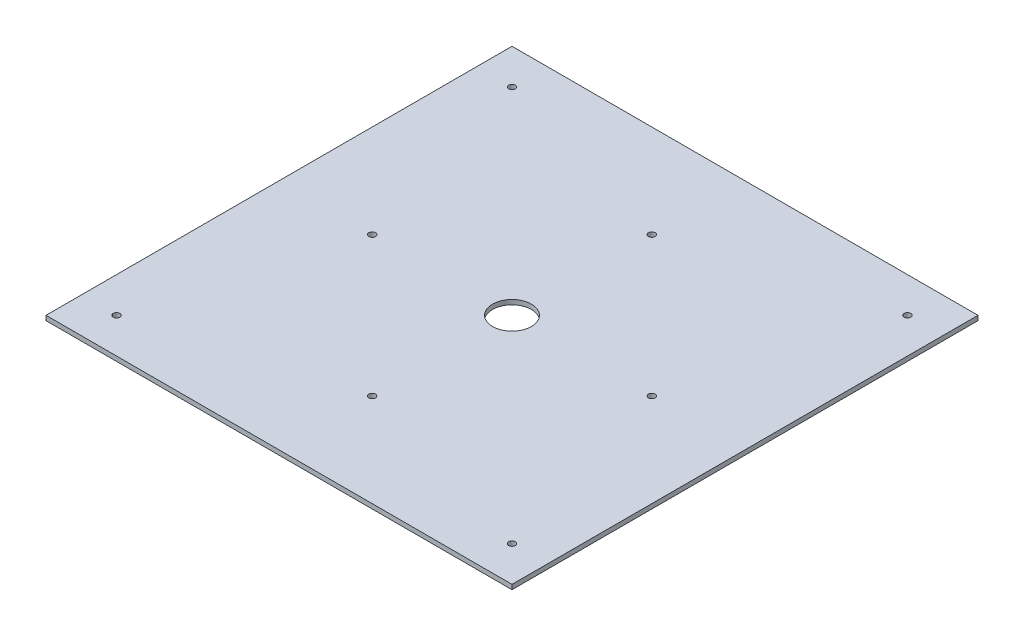
ISO-10303-21;
HEADER;
FILE_DESCRIPTION(('STEP AP214'),'2;1');
FILE_NAME('part.step','',(''),(''),'','','');
FILE_SCHEMA(('AUTOMOTIVE_DESIGN { 1 0 10303 214 1 1 1 1 }'));
ENDSEC;
DATA;
#1=APPLICATION_CONTEXT('core data for automotive mechanical design processes');
#2=APPLICATION_PROTOCOL_DEFINITION('international standard','automotive_design',2000,#1);
#3=PRODUCT_CONTEXT('',#1,'mechanical');
#4=PRODUCT('Part','Part','',(#3));
#5=PRODUCT_RELATED_PRODUCT_CATEGORY('part','',(#4));
#6=PRODUCT_DEFINITION_FORMATION('','',#4);
#7=PRODUCT_DEFINITION_CONTEXT('part definition',#1,'design');
#8=PRODUCT_DEFINITION('design','',#6,#7);
#9=PRODUCT_DEFINITION_SHAPE('','',#8);
#10=(LENGTH_UNIT() NAMED_UNIT(*) SI_UNIT(.MILLI.,.METRE.));
#11=(NAMED_UNIT(*) PLANE_ANGLE_UNIT() SI_UNIT($,.RADIAN.));
#12=(NAMED_UNIT(*) SI_UNIT($,.STERADIAN.) SOLID_ANGLE_UNIT());
#13=UNCERTAINTY_MEASURE_WITH_UNIT(LENGTH_MEASURE(1.E-05),#10,'distance_accuracy_value','');
#14=(GEOMETRIC_REPRESENTATION_CONTEXT(3) GLOBAL_UNCERTAINTY_ASSIGNED_CONTEXT((#13)) GLOBAL_UNIT_ASSIGNED_CONTEXT((#10,
#11,#12)) REPRESENTATION_CONTEXT('',''));
#15=CARTESIAN_POINT('',(0.,0.,0.));
#16=DIRECTION('',(0.,0.,1.));
#17=DIRECTION('',(1.,0.,0.));
#18=AXIS2_PLACEMENT_3D('',#15,#16,#17);
#19=CARTESIAN_POINT('',(0.,3.,0.));
#20=DIRECTION('',(0.,-1.,0.));
#21=DIRECTION('',(0.,0.,-1.));
#22=AXIS2_PLACEMENT_3D('',#19,#20,#21);
#23=PLANE('',#22);
#24=DIRECTION('',(0.,0.,1.));
#25=VECTOR('',#24,1.);
#26=CARTESIAN_POINT('',(0.,3.,0.));
#27=LINE('',#26,#25);
#28=CARTESIAN_POINT('',(0.,3.,-300.));
#29=VERTEX_POINT('',#28);
#30=CARTESIAN_POINT('',(0.,3.,0.));
#31=VERTEX_POINT('',#30);
#32=EDGE_CURVE('E92',#29,#31,#27,.T.);
#33=ORIENTED_EDGE('',*,*,#32,.T.);
#34=DIRECTION('',(1.,0.,0.));
#35=VECTOR('',#34,1.);
#36=CARTESIAN_POINT('',(0.,3.,0.));
#37=LINE('',#36,#35);
#38=CARTESIAN_POINT('',(300.,3.,0.));
#39=VERTEX_POINT('',#38);
#40=EDGE_CURVE('E87',#31,#39,#37,.T.);
#41=ORIENTED_EDGE('',*,*,#40,.T.);
#42=DIRECTION('',(0.,0.,-1.));
#43=VECTOR('',#42,1.);
#44=CARTESIAN_POINT('',(300.,3.,0.));
#45=LINE('',#44,#43);
#46=CARTESIAN_POINT('',(300.,3.,-300.));
#47=VERTEX_POINT('',#46);
#48=EDGE_CURVE('E90',#39,#47,#45,.T.);
#49=ORIENTED_EDGE('',*,*,#48,.T.);
#50=DIRECTION('',(-1.,0.,0.));
#51=VECTOR('',#50,1.);
#52=CARTESIAN_POINT('',(0.,3.,-300.));
#53=LINE('',#52,#51);
#54=EDGE_CURVE('E57',#47,#29,#53,.T.);
#55=ORIENTED_EDGE('',*,*,#54,.T.);
#56=EDGE_LOOP('',(#33,#41,#49,#55));
#57=FACE_BOUND('',#56,.T.);
#58=CARTESIAN_POINT('',(150.,3.,-150.));
#59=DIRECTION('',(0.,1.,0.));
#60=DIRECTION('',(0.,0.,1.));
#61=AXIS2_PLACEMENT_3D('',#58,#59,#60);
#62=CIRCLE('',#61,12.5);
#63=CARTESIAN_POINT('',(150.,3.,-137.5));
#64=VERTEX_POINT('',#63);
#65=EDGE_CURVE('E112',#64,#64,#62,.T.);
#66=ORIENTED_EDGE('',*,*,#65,.F.);
#67=EDGE_LOOP('',(#66));
#68=FACE_BOUND('',#67,.T.);
#69=CARTESIAN_POINT('',(22.7207793864215,3.,-277.279220613579));
#70=DIRECTION('',(0.,1.,0.));
#71=DIRECTION('',(0.,0.,1.));
#72=AXIS2_PLACEMENT_3D('',#69,#70,#71);
#73=CIRCLE('',#72,2.15);
#74=CARTESIAN_POINT('',(22.7207793864215,3.,-275.129220613579));
#75=VERTEX_POINT('',#74);
#76=EDGE_CURVE('E134',#75,#75,#73,.T.);
#77=ORIENTED_EDGE('',*,*,#76,.F.);
#78=EDGE_LOOP('',(#77));
#79=FACE_BOUND('',#78,.T.);
#80=CARTESIAN_POINT('',(150.,3.,-240.));
#81=DIRECTION('',(0.,1.,0.));
#82=DIRECTION('',(0.,0.,1.));
#83=AXIS2_PLACEMENT_3D('',#80,#81,#82);
#84=CIRCLE('',#83,2.15000000000002);
#85=CARTESIAN_POINT('',(150.,3.,-237.85));
#86=VERTEX_POINT('',#85);
#87=EDGE_CURVE('E142',#86,#86,#84,.T.);
#88=ORIENTED_EDGE('',*,*,#87,.F.);
#89=EDGE_LOOP('',(#88));
#90=FACE_BOUND('',#89,.T.);
#91=CARTESIAN_POINT('',(277.279220613579,3.,-277.279220613579));
#92=DIRECTION('',(0.,1.,0.));
#93=DIRECTION('',(0.,0.,1.));
#94=AXIS2_PLACEMENT_3D('',#91,#92,#93);
#95=CIRCLE('',#94,2.14999999999997);
#96=CARTESIAN_POINT('',(277.279220613579,3.,-275.129220613579));
#97=VERTEX_POINT('',#96);
#98=EDGE_CURVE('E150',#97,#97,#95,.T.);
#99=ORIENTED_EDGE('',*,*,#98,.F.);
#100=EDGE_LOOP('',(#99));
#101=FACE_BOUND('',#100,.T.);
#102=CARTESIAN_POINT('',(277.279220613579,3.,-22.7207793864214));
#103=DIRECTION('',(0.,1.,0.));
#104=DIRECTION('',(0.,0.,1.));
#105=AXIS2_PLACEMENT_3D('',#102,#103,#104);
#106=CIRCLE('',#105,2.14999999999996);
#107=CARTESIAN_POINT('',(277.279220613579,3.,-20.5707793864215));
#108=VERTEX_POINT('',#107);
#109=EDGE_CURVE('E158',#108,#108,#106,.T.);
#110=ORIENTED_EDGE('',*,*,#109,.F.);
#111=EDGE_LOOP('',(#110));
#112=FACE_BOUND('',#111,.T.);
#113=CARTESIAN_POINT('',(22.7207793864215,3.,-22.7207793864214));
#114=DIRECTION('',(0.,1.,0.));
#115=DIRECTION('',(0.,0.,1.));
#116=AXIS2_PLACEMENT_3D('',#113,#114,#115);
#117=CIRCLE('',#116,2.15);
#118=CARTESIAN_POINT('',(22.7207793864215,3.,-20.5707793864214));
#119=VERTEX_POINT('',#118);
#120=EDGE_CURVE('E166',#119,#119,#117,.T.);
#121=ORIENTED_EDGE('',*,*,#120,.F.);
#122=EDGE_LOOP('',(#121));
#123=FACE_BOUND('',#122,.T.);
#124=CARTESIAN_POINT('',(240.000000000001,3.,-150.000000000001));
#125=DIRECTION('',(0.,1.,0.));
#126=DIRECTION('',(0.,0.,1.));
#127=AXIS2_PLACEMENT_3D('',#124,#125,#126);
#128=CIRCLE('',#127,2.15000000000002);
#129=CARTESIAN_POINT('',(240.000000000001,3.,-147.850000000001));
#130=VERTEX_POINT('',#129);
#131=EDGE_CURVE('E174',#130,#130,#128,.T.);
#132=ORIENTED_EDGE('',*,*,#131,.F.);
#133=EDGE_LOOP('',(#132));
#134=FACE_BOUND('',#133,.T.);
#135=CARTESIAN_POINT('',(150.000000000002,3.,-60.));
#136=DIRECTION('',(0.,1.,0.));
#137=DIRECTION('',(0.,0.,1.));
#138=AXIS2_PLACEMENT_3D('',#135,#136,#137);
#139=CIRCLE('',#138,2.15000000000004);
#140=CARTESIAN_POINT('',(150.000000000002,3.,-57.85));
#141=VERTEX_POINT('',#140);
#142=EDGE_CURVE('E182',#141,#141,#139,.T.);
#143=ORIENTED_EDGE('',*,*,#142,.F.);
#144=EDGE_LOOP('',(#143));
#145=FACE_BOUND('',#144,.T.);
#146=CARTESIAN_POINT('',(60.0000000000012,3.,-150.));
#147=DIRECTION('',(0.,1.,0.));
#148=DIRECTION('',(0.,0.,1.));
#149=AXIS2_PLACEMENT_3D('',#146,#147,#148);
#150=CIRCLE('',#149,2.15000000000002);
#151=CARTESIAN_POINT('',(60.0000000000012,3.,-147.85));
#152=VERTEX_POINT('',#151);
#153=EDGE_CURVE('E190',#152,#152,#150,.T.);
#154=ORIENTED_EDGE('',*,*,#153,.F.);
#155=EDGE_LOOP('',(#154));
#156=FACE_BOUND('',#155,.T.);
#157=ADVANCED_FACE('F39',(#57,#68,#79,#90,#101,#112,#123,#134,#145,#156),#23,.F.);
#158=CARTESIAN_POINT('',(0.,0.,0.));
#159=DIRECTION('',(0.,-1.,0.));
#160=DIRECTION('',(0.,0.,-1.));
#161=AXIS2_PLACEMENT_3D('',#158,#159,#160);
#162=PLANE('',#161);
#163=CARTESIAN_POINT('',(150.000000000002,0.,-60.));
#164=DIRECTION('',(0.,1.,0.));
#165=DIRECTION('',(0.,0.,1.));
#166=AXIS2_PLACEMENT_3D('',#163,#164,#165);
#167=CIRCLE('',#166,2.15000000000004);
#168=CARTESIAN_POINT('',(150.000000000002,0.,-57.85));
#169=VERTEX_POINT('',#168);
#170=EDGE_CURVE('E186',#169,#169,#167,.T.);
#171=ORIENTED_EDGE('',*,*,#170,.T.);
#172=EDGE_LOOP('',(#171));
#173=FACE_BOUND('',#172,.T.);
#174=CARTESIAN_POINT('',(22.7207793864215,0.,-22.7207793864214));
#175=DIRECTION('',(0.,1.,0.));
#176=DIRECTION('',(0.,0.,1.));
#177=AXIS2_PLACEMENT_3D('',#174,#175,#176);
#178=CIRCLE('',#177,2.15);
#179=CARTESIAN_POINT('',(22.7207793864215,0.,-20.5707793864214));
#180=VERTEX_POINT('',#179);
#181=EDGE_CURVE('E170',#180,#180,#178,.T.);
#182=ORIENTED_EDGE('',*,*,#181,.T.);
#183=EDGE_LOOP('',(#182));
#184=FACE_BOUND('',#183,.T.);
#185=CARTESIAN_POINT('',(277.279220613579,0.,-277.279220613579));
#186=DIRECTION('',(0.,1.,0.));
#187=DIRECTION('',(0.,0.,1.));
#188=AXIS2_PLACEMENT_3D('',#185,#186,#187);
#189=CIRCLE('',#188,2.14999999999997);
#190=CARTESIAN_POINT('',(277.279220613579,0.,-275.129220613579));
#191=VERTEX_POINT('',#190);
#192=EDGE_CURVE('E154',#191,#191,#189,.T.);
#193=ORIENTED_EDGE('',*,*,#192,.T.);
#194=EDGE_LOOP('',(#193));
#195=FACE_BOUND('',#194,.T.);
#196=CARTESIAN_POINT('',(22.7207793864215,0.,-277.279220613579));
#197=DIRECTION('',(0.,1.,0.));
#198=DIRECTION('',(0.,0.,1.));
#199=AXIS2_PLACEMENT_3D('',#196,#197,#198);
#200=CIRCLE('',#199,2.15);
#201=CARTESIAN_POINT('',(22.7207793864215,0.,-275.129220613579));
#202=VERTEX_POINT('',#201);
#203=EDGE_CURVE('E138',#202,#202,#200,.T.);
#204=ORIENTED_EDGE('',*,*,#203,.T.);
#205=EDGE_LOOP('',(#204));
#206=FACE_BOUND('',#205,.T.);
#207=DIRECTION('',(0.,0.,1.));
#208=VECTOR('',#207,1.);
#209=CARTESIAN_POINT('',(0.,0.,0.));
#210=LINE('',#209,#208);
#211=CARTESIAN_POINT('',(0.,0.,-300.));
#212=VERTEX_POINT('',#211);
#213=CARTESIAN_POINT('',(0.,0.,0.));
#214=VERTEX_POINT('',#213);
#215=EDGE_CURVE('E108',#212,#214,#210,.T.);
#216=ORIENTED_EDGE('',*,*,#215,.F.);
#217=DIRECTION('',(-1.,0.,0.));
#218=VECTOR('',#217,1.);
#219=CARTESIAN_POINT('',(0.,0.,-300.));
#220=LINE('',#219,#218);
#221=CARTESIAN_POINT('',(300.,0.,-300.));
#222=VERTEX_POINT('',#221);
#223=EDGE_CURVE('E80',#222,#212,#220,.T.);
#224=ORIENTED_EDGE('',*,*,#223,.F.);
#225=DIRECTION('',(0.,0.,-1.));
#226=VECTOR('',#225,1.);
#227=CARTESIAN_POINT('',(300.,0.,0.));
#228=LINE('',#227,#226);
#229=CARTESIAN_POINT('',(300.,0.,0.));
#230=VERTEX_POINT('',#229);
#231=EDGE_CURVE('E74',#230,#222,#228,.T.);
#232=ORIENTED_EDGE('',*,*,#231,.F.);
#233=DIRECTION('',(1.,0.,0.));
#234=VECTOR('',#233,1.);
#235=CARTESIAN_POINT('',(0.,0.,0.));
#236=LINE('',#235,#234);
#237=EDGE_CURVE('E97',#214,#230,#236,.T.);
#238=ORIENTED_EDGE('',*,*,#237,.F.);
#239=EDGE_LOOP('',(#216,#224,#232,#238));
#240=FACE_BOUND('',#239,.T.);
#241=CARTESIAN_POINT('',(150.,0.,-150.));
#242=DIRECTION('',(0.,1.,0.));
#243=DIRECTION('',(0.,0.,1.));
#244=AXIS2_PLACEMENT_3D('',#241,#242,#243);
#245=CIRCLE('',#244,12.5);
#246=CARTESIAN_POINT('',(150.,0.,-137.5));
#247=VERTEX_POINT('',#246);
#248=EDGE_CURVE('E130',#247,#247,#245,.T.);
#249=ORIENTED_EDGE('',*,*,#248,.T.);
#250=EDGE_LOOP('',(#249));
#251=FACE_BOUND('',#250,.T.);
#252=CARTESIAN_POINT('',(150.,0.,-240.));
#253=DIRECTION('',(0.,1.,0.));
#254=DIRECTION('',(0.,0.,1.));
#255=AXIS2_PLACEMENT_3D('',#252,#253,#254);
#256=CIRCLE('',#255,2.15000000000002);
#257=CARTESIAN_POINT('',(150.,0.,-237.85));
#258=VERTEX_POINT('',#257);
#259=EDGE_CURVE('E146',#258,#258,#256,.T.);
#260=ORIENTED_EDGE('',*,*,#259,.T.);
#261=EDGE_LOOP('',(#260));
#262=FACE_BOUND('',#261,.T.);
#263=CARTESIAN_POINT('',(277.279220613579,0.,-22.7207793864214));
#264=DIRECTION('',(0.,1.,0.));
#265=DIRECTION('',(0.,0.,1.));
#266=AXIS2_PLACEMENT_3D('',#263,#264,#265);
#267=CIRCLE('',#266,2.14999999999996);
#268=CARTESIAN_POINT('',(277.279220613579,0.,-20.5707793864215));
#269=VERTEX_POINT('',#268);
#270=EDGE_CURVE('E162',#269,#269,#267,.T.);
#271=ORIENTED_EDGE('',*,*,#270,.T.);
#272=EDGE_LOOP('',(#271));
#273=FACE_BOUND('',#272,.T.);
#274=CARTESIAN_POINT('',(240.000000000001,0.,-150.000000000001));
#275=DIRECTION('',(0.,1.,0.));
#276=DIRECTION('',(0.,0.,1.));
#277=AXIS2_PLACEMENT_3D('',#274,#275,#276);
#278=CIRCLE('',#277,2.15000000000002);
#279=CARTESIAN_POINT('',(240.000000000001,0.,-147.850000000001));
#280=VERTEX_POINT('',#279);
#281=EDGE_CURVE('E178',#280,#280,#278,.T.);
#282=ORIENTED_EDGE('',*,*,#281,.T.);
#283=EDGE_LOOP('',(#282));
#284=FACE_BOUND('',#283,.T.);
#285=CARTESIAN_POINT('',(60.0000000000012,0.,-150.));
#286=DIRECTION('',(0.,1.,0.));
#287=DIRECTION('',(0.,0.,1.));
#288=AXIS2_PLACEMENT_3D('',#285,#286,#287);
#289=CIRCLE('',#288,2.15000000000002);
#290=CARTESIAN_POINT('',(60.0000000000012,0.,-147.85));
#291=VERTEX_POINT('',#290);
#292=EDGE_CURVE('E194',#291,#291,#289,.T.);
#293=ORIENTED_EDGE('',*,*,#292,.T.);
#294=EDGE_LOOP('',(#293));
#295=FACE_BOUND('',#294,.T.);
#296=ADVANCED_FACE('F125',(#173,#184,#195,#206,#240,#251,#262,#273,#284,#295),#162,.T.);
#297=CARTESIAN_POINT('',(0.,3.,0.));
#298=DIRECTION('',(1.,0.,0.));
#299=DIRECTION('',(0.,0.,-1.));
#300=AXIS2_PLACEMENT_3D('',#297,#298,#299);
#301=PLANE('',#300);
#302=ORIENTED_EDGE('',*,*,#215,.T.);
#303=DIRECTION('',(0.,-1.,0.));
#304=VECTOR('',#303,1.);
#305=CARTESIAN_POINT('',(0.,3.,0.));
#306=LINE('',#305,#304);
#307=EDGE_CURVE('E11',#31,#214,#306,.T.);
#308=ORIENTED_EDGE('',*,*,#307,.F.);
#309=ORIENTED_EDGE('',*,*,#32,.F.);
#310=DIRECTION('',(0.,-1.,0.));
#311=VECTOR('',#310,1.);
#312=CARTESIAN_POINT('',(0.,3.,-300.));
#313=LINE('',#312,#311);
#314=EDGE_CURVE('E104',#29,#212,#313,.T.);
#315=ORIENTED_EDGE('',*,*,#314,.T.);
#316=EDGE_LOOP('',(#302,#308,#309,#315));
#317=FACE_BOUND('',#316,.T.);
#318=ADVANCED_FACE('F41',(#317),#301,.F.);
#319=CARTESIAN_POINT('',(0.,3.,0.));
#320=DIRECTION('',(0.,0.,-1.));
#321=DIRECTION('',(-1.,0.,0.));
#322=AXIS2_PLACEMENT_3D('',#319,#320,#321);
#323=PLANE('',#322);
#324=ORIENTED_EDGE('',*,*,#237,.T.);
#325=DIRECTION('',(0.,-1.,0.));
#326=VECTOR('',#325,1.);
#327=CARTESIAN_POINT('',(300.,3.,0.));
#328=LINE('',#327,#326);
#329=EDGE_CURVE('E49',#39,#230,#328,.T.);
#330=ORIENTED_EDGE('',*,*,#329,.F.);
#331=ORIENTED_EDGE('',*,*,#40,.F.);
#332=ORIENTED_EDGE('',*,*,#307,.T.);
#333=EDGE_LOOP('',(#324,#330,#331,#332));
#334=FACE_BOUND('',#333,.T.);
#335=ADVANCED_FACE('F96',(#334),#323,.F.);
#336=CARTESIAN_POINT('',(300.,3.,0.));
#337=DIRECTION('',(-1.,0.,0.));
#338=DIRECTION('',(0.,0.,1.));
#339=AXIS2_PLACEMENT_3D('',#336,#337,#338);
#340=PLANE('',#339);
#341=ORIENTED_EDGE('',*,*,#231,.T.);
#342=DIRECTION('',(0.,-1.,0.));
#343=VECTOR('',#342,1.);
#344=CARTESIAN_POINT('',(300.,3.,-300.));
#345=LINE('',#344,#343);
#346=EDGE_CURVE('E99',#47,#222,#345,.T.);
#347=ORIENTED_EDGE('',*,*,#346,.F.);
#348=ORIENTED_EDGE('',*,*,#48,.F.);
#349=ORIENTED_EDGE('',*,*,#329,.T.);
#350=EDGE_LOOP('',(#341,#347,#348,#349));
#351=FACE_BOUND('',#350,.T.);
#352=ADVANCED_FACE('F100',(#351),#340,.F.);
#353=CARTESIAN_POINT('',(0.,3.,-300.));
#354=DIRECTION('',(0.,0.,1.));
#355=DIRECTION('',(1.,0.,0.));
#356=AXIS2_PLACEMENT_3D('',#353,#354,#355);
#357=PLANE('',#356);
#358=ORIENTED_EDGE('',*,*,#223,.T.);
#359=ORIENTED_EDGE('',*,*,#314,.F.);
#360=ORIENTED_EDGE('',*,*,#54,.F.);
#361=ORIENTED_EDGE('',*,*,#346,.T.);
#362=EDGE_LOOP('',(#358,#359,#360,#361));
#363=FACE_BOUND('',#362,.T.);
#364=ADVANCED_FACE('F122',(#363),#357,.F.);
#365=CARTESIAN_POINT('',(150.,3.,-150.));
#366=DIRECTION('',(0.,-1.,0.));
#367=DIRECTION('',(0.,0.,-1.));
#368=AXIS2_PLACEMENT_3D('',#365,#366,#367);
#369=CYLINDRICAL_SURFACE('',#368,12.5);
#370=ORIENTED_EDGE('',*,*,#65,.T.);
#371=EDGE_LOOP('',(#370));
#372=FACE_BOUND('',#371,.T.);
#373=ORIENTED_EDGE('',*,*,#248,.F.);
#374=EDGE_LOOP('',(#373));
#375=FACE_BOUND('',#374,.T.);
#376=ADVANCED_FACE('F213',(#372,#375),#369,.F.);
#377=CARTESIAN_POINT('',(22.7207793864215,3.,-277.279220613579));
#378=DIRECTION('',(0.,-1.,0.));
#379=DIRECTION('',(0.,0.,-1.));
#380=AXIS2_PLACEMENT_3D('',#377,#378,#379);
#381=CYLINDRICAL_SURFACE('',#380,2.15);
#382=ORIENTED_EDGE('',*,*,#76,.T.);
#383=EDGE_LOOP('',(#382));
#384=FACE_BOUND('',#383,.T.);
#385=ORIENTED_EDGE('',*,*,#203,.F.);
#386=EDGE_LOOP('',(#385));
#387=FACE_BOUND('',#386,.T.);
#388=ADVANCED_FACE('F259',(#384,#387),#381,.F.);
#389=CARTESIAN_POINT('',(150.,3.,-240.));
#390=DIRECTION('',(0.,-1.,0.));
#391=DIRECTION('',(0.,0.,-1.));
#392=AXIS2_PLACEMENT_3D('',#389,#390,#391);
#393=CYLINDRICAL_SURFACE('',#392,2.15000000000002);
#394=ORIENTED_EDGE('',*,*,#87,.T.);
#395=EDGE_LOOP('',(#394));
#396=FACE_BOUND('',#395,.T.);
#397=ORIENTED_EDGE('',*,*,#259,.F.);
#398=EDGE_LOOP('',(#397));
#399=FACE_BOUND('',#398,.T.);
#400=ADVANCED_FACE('F267',(#396,#399),#393,.F.);
#401=CARTESIAN_POINT('',(277.279220613579,3.,-277.279220613579));
#402=DIRECTION('',(0.,-1.,0.));
#403=DIRECTION('',(0.,0.,-1.));
#404=AXIS2_PLACEMENT_3D('',#401,#402,#403);
#405=CYLINDRICAL_SURFACE('',#404,2.14999999999997);
#406=ORIENTED_EDGE('',*,*,#98,.T.);
#407=EDGE_LOOP('',(#406));
#408=FACE_BOUND('',#407,.T.);
#409=ORIENTED_EDGE('',*,*,#192,.F.);
#410=EDGE_LOOP('',(#409));
#411=FACE_BOUND('',#410,.T.);
#412=ADVANCED_FACE('F275',(#408,#411),#405,.F.);
#413=CARTESIAN_POINT('',(277.279220613579,3.,-22.7207793864214));
#414=DIRECTION('',(0.,-1.,0.));
#415=DIRECTION('',(0.,0.,-1.));
#416=AXIS2_PLACEMENT_3D('',#413,#414,#415);
#417=CYLINDRICAL_SURFACE('',#416,2.14999999999996);
#418=ORIENTED_EDGE('',*,*,#109,.T.);
#419=EDGE_LOOP('',(#418));
#420=FACE_BOUND('',#419,.T.);
#421=ORIENTED_EDGE('',*,*,#270,.F.);
#422=EDGE_LOOP('',(#421));
#423=FACE_BOUND('',#422,.T.);
#424=ADVANCED_FACE('F284',(#420,#423),#417,.F.);
#425=CARTESIAN_POINT('',(22.7207793864215,3.,-22.7207793864214));
#426=DIRECTION('',(0.,-1.,0.));
#427=DIRECTION('',(0.,0.,-1.));
#428=AXIS2_PLACEMENT_3D('',#425,#426,#427);
#429=CYLINDRICAL_SURFACE('',#428,2.15);
#430=ORIENTED_EDGE('',*,*,#120,.T.);
#431=EDGE_LOOP('',(#430));
#432=FACE_BOUND('',#431,.T.);
#433=ORIENTED_EDGE('',*,*,#181,.F.);
#434=EDGE_LOOP('',(#433));
#435=FACE_BOUND('',#434,.T.);
#436=ADVANCED_FACE('F293',(#432,#435),#429,.F.);
#437=CARTESIAN_POINT('',(240.000000000001,3.,-150.000000000001));
#438=DIRECTION('',(0.,-1.,0.));
#439=DIRECTION('',(0.,0.,-1.));
#440=AXIS2_PLACEMENT_3D('',#437,#438,#439);
#441=CYLINDRICAL_SURFACE('',#440,2.15000000000002);
#442=ORIENTED_EDGE('',*,*,#131,.T.);
#443=EDGE_LOOP('',(#442));
#444=FACE_BOUND('',#443,.T.);
#445=ORIENTED_EDGE('',*,*,#281,.F.);
#446=EDGE_LOOP('',(#445));
#447=FACE_BOUND('',#446,.T.);
#448=ADVANCED_FACE('F302',(#444,#447),#441,.F.);
#449=CARTESIAN_POINT('',(150.000000000002,3.,-60.));
#450=DIRECTION('',(0.,-1.,0.));
#451=DIRECTION('',(0.,0.,-1.));
#452=AXIS2_PLACEMENT_3D('',#449,#450,#451);
#453=CYLINDRICAL_SURFACE('',#452,2.15000000000004);
#454=ORIENTED_EDGE('',*,*,#142,.T.);
#455=EDGE_LOOP('',(#454));
#456=FACE_BOUND('',#455,.T.);
#457=ORIENTED_EDGE('',*,*,#170,.F.);
#458=EDGE_LOOP('',(#457));
#459=FACE_BOUND('',#458,.T.);
#460=ADVANCED_FACE('F311',(#456,#459),#453,.F.);
#461=CARTESIAN_POINT('',(60.0000000000012,3.,-150.));
#462=DIRECTION('',(0.,-1.,0.));
#463=DIRECTION('',(0.,0.,-1.));
#464=AXIS2_PLACEMENT_3D('',#461,#462,#463);
#465=CYLINDRICAL_SURFACE('',#464,2.15000000000002);
#466=ORIENTED_EDGE('',*,*,#153,.T.);
#467=EDGE_LOOP('',(#466));
#468=FACE_BOUND('',#467,.T.);
#469=ORIENTED_EDGE('',*,*,#292,.F.);
#470=EDGE_LOOP('',(#469));
#471=FACE_BOUND('',#470,.T.);
#472=ADVANCED_FACE('F202',(#468,#471),#465,.F.);
#473=CLOSED_SHELL('',(#157,#296,#318,#335,#352,#364,#376,#388,#400,#412,#424,#436,#448,#460,#472));
#474=MANIFOLD_SOLID_BREP('B2',#473);
#475=ADVANCED_BREP_SHAPE_REPRESENTATION('',(#18,#474),#14);
#476=SHAPE_DEFINITION_REPRESENTATION(#9,#475);
ENDSEC;
END-ISO-10303-21;
